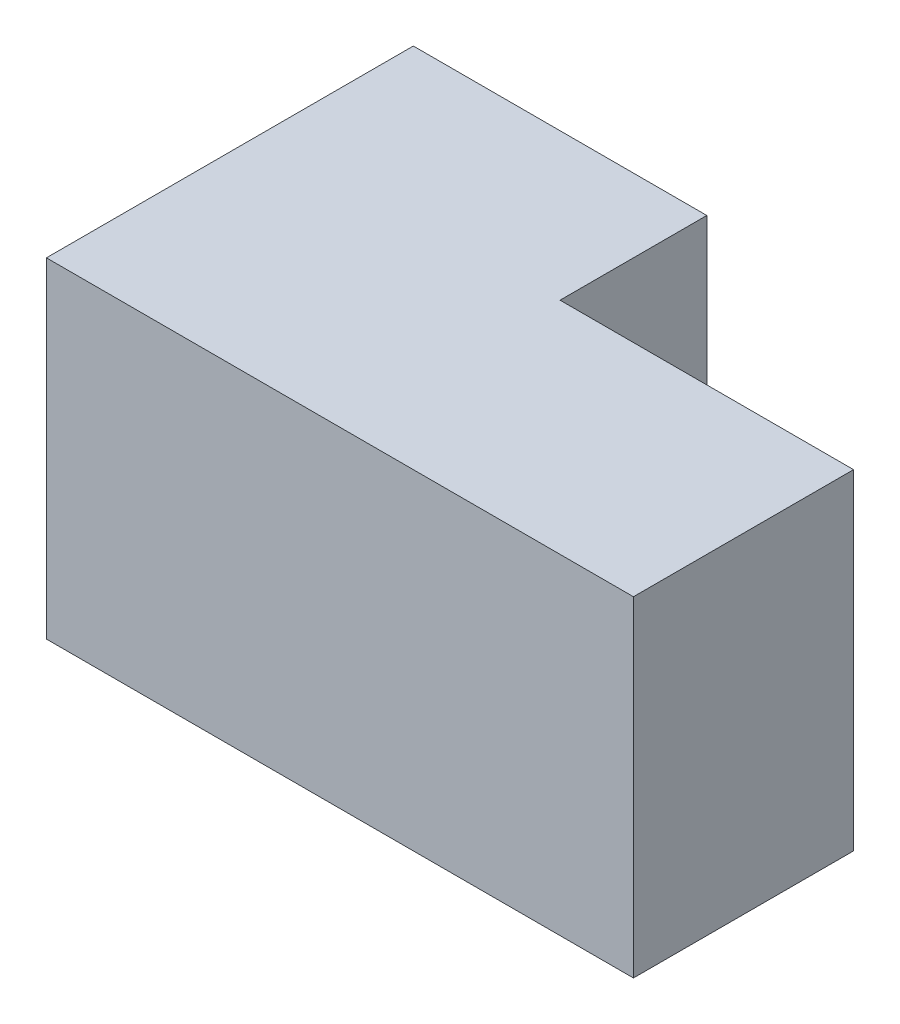
ISO-10303-21;
HEADER;
FILE_DESCRIPTION(('STEP AP214'),'2;1');
FILE_NAME('part.step','',(''),(''),'','','');
FILE_SCHEMA(('AUTOMOTIVE_DESIGN { 1 0 10303 214 1 1 1 1 }'));
ENDSEC;
DATA;
#1=APPLICATION_CONTEXT('core data for automotive mechanical design processes');
#2=APPLICATION_PROTOCOL_DEFINITION('international standard','automotive_design',2000,#1);
#3=PRODUCT_CONTEXT('',#1,'mechanical');
#4=PRODUCT('Part','Part','',(#3));
#5=PRODUCT_RELATED_PRODUCT_CATEGORY('part','',(#4));
#6=PRODUCT_DEFINITION_FORMATION('','',#4);
#7=PRODUCT_DEFINITION_CONTEXT('part definition',#1,'design');
#8=PRODUCT_DEFINITION('design','',#6,#7);
#9=PRODUCT_DEFINITION_SHAPE('','',#8);
#10=(LENGTH_UNIT() NAMED_UNIT(*) SI_UNIT(.MILLI.,.METRE.));
#11=(NAMED_UNIT(*) PLANE_ANGLE_UNIT() SI_UNIT($,.RADIAN.));
#12=(NAMED_UNIT(*) SI_UNIT($,.STERADIAN.) SOLID_ANGLE_UNIT());
#13=UNCERTAINTY_MEASURE_WITH_UNIT(LENGTH_MEASURE(1.E-05),#10,'distance_accuracy_value','');
#14=(GEOMETRIC_REPRESENTATION_CONTEXT(3) GLOBAL_UNCERTAINTY_ASSIGNED_CONTEXT((#13)) GLOBAL_UNIT_ASSIGNED_CONTEXT((#10,
#11,#12)) REPRESENTATION_CONTEXT('',''));
#15=CARTESIAN_POINT('',(0.,0.,0.));
#16=DIRECTION('',(0.,0.,1.));
#17=DIRECTION('',(1.,0.,0.));
#18=AXIS2_PLACEMENT_3D('',#15,#16,#17);
#19=CARTESIAN_POINT('',(25.4,28.575,-31.75));
#20=DIRECTION('',(0.,0.,1.));
#21=DIRECTION('',(1.,0.,0.));
#22=AXIS2_PLACEMENT_3D('',#19,#20,#21);
#23=PLANE('',#22);
#24=DIRECTION('',(-1.,0.,0.));
#25=VECTOR('',#24,1.);
#26=CARTESIAN_POINT('',(25.4,0.,-31.75));
#27=LINE('',#26,#25);
#28=CARTESIAN_POINT('',(25.4,0.,-31.75));
#29=VERTEX_POINT('',#28);
#30=CARTESIAN_POINT('',(0.,0.,-31.75));
#31=VERTEX_POINT('',#30);
#32=EDGE_CURVE('E132',#29,#31,#27,.T.);
#33=ORIENTED_EDGE('',*,*,#32,.T.);
#34=DIRECTION('',(0.,-1.,0.));
#35=VECTOR('',#34,1.);
#36=CARTESIAN_POINT('',(0.,28.575,-31.75));
#37=LINE('',#36,#35);
#38=CARTESIAN_POINT('',(0.,28.575,-31.75));
#39=VERTEX_POINT('',#38);
#40=EDGE_CURVE('E11',#39,#31,#37,.T.);
#41=ORIENTED_EDGE('',*,*,#40,.F.);
#42=DIRECTION('',(-1.,0.,0.));
#43=VECTOR('',#42,1.);
#44=CARTESIAN_POINT('',(25.4,28.575,-31.75));
#45=LINE('',#44,#43);
#46=CARTESIAN_POINT('',(25.4,28.575,-31.75));
#47=VERTEX_POINT('',#46);
#48=EDGE_CURVE('E148',#47,#39,#45,.T.);
#49=ORIENTED_EDGE('',*,*,#48,.F.);
#50=DIRECTION('',(0.,-1.,0.));
#51=VECTOR('',#50,1.);
#52=CARTESIAN_POINT('',(25.4,28.575,-31.75));
#53=LINE('',#52,#51);
#54=EDGE_CURVE('E128',#47,#29,#53,.T.);
#55=ORIENTED_EDGE('',*,*,#54,.T.);
#56=EDGE_LOOP('',(#33,#41,#49,#55));
#57=FACE_BOUND('',#56,.T.);
#58=ADVANCED_FACE('F42',(#57),#23,.F.);
#59=CARTESIAN_POINT('',(0.,28.575,-31.75));
#60=DIRECTION('',(1.,0.,0.));
#61=DIRECTION('',(0.,0.,-1.));
#62=AXIS2_PLACEMENT_3D('',#59,#60,#61);
#63=PLANE('',#62);
#64=DIRECTION('',(0.,0.,1.));
#65=VECTOR('',#64,1.);
#66=CARTESIAN_POINT('',(0.,0.,-31.75));
#67=LINE('',#66,#65);
#68=CARTESIAN_POINT('',(0.,0.,0.));
#69=VERTEX_POINT('',#68);
#70=EDGE_CURVE('E136',#31,#69,#67,.T.);
#71=ORIENTED_EDGE('',*,*,#70,.T.);
#72=DIRECTION('',(0.,-1.,0.));
#73=VECTOR('',#72,1.);
#74=CARTESIAN_POINT('',(0.,28.575,0.));
#75=LINE('',#74,#73);
#76=CARTESIAN_POINT('',(0.,28.575,0.));
#77=VERTEX_POINT('',#76);
#78=EDGE_CURVE('E51',#77,#69,#75,.T.);
#79=ORIENTED_EDGE('',*,*,#78,.F.);
#80=DIRECTION('',(0.,0.,1.));
#81=VECTOR('',#80,1.);
#82=CARTESIAN_POINT('',(0.,28.575,-31.75));
#83=LINE('',#82,#81);
#84=EDGE_CURVE('E96',#39,#77,#83,.T.);
#85=ORIENTED_EDGE('',*,*,#84,.F.);
#86=ORIENTED_EDGE('',*,*,#40,.T.);
#87=EDGE_LOOP('',(#71,#79,#85,#86));
#88=FACE_BOUND('',#87,.T.);
#89=ADVANCED_FACE('F177',(#88),#63,.F.);
#90=CARTESIAN_POINT('',(0.,28.575,0.));
#91=DIRECTION('',(0.,0.,-1.));
#92=DIRECTION('',(-1.,0.,0.));
#93=AXIS2_PLACEMENT_3D('',#90,#91,#92);
#94=PLANE('',#93);
#95=DIRECTION('',(1.,0.,0.));
#96=VECTOR('',#95,1.);
#97=CARTESIAN_POINT('',(0.,0.,0.));
#98=LINE('',#97,#96);
#99=CARTESIAN_POINT('',(50.8,0.,0.));
#100=VERTEX_POINT('',#99);
#101=EDGE_CURVE('E139',#69,#100,#98,.T.);
#102=ORIENTED_EDGE('',*,*,#101,.T.);
#103=DIRECTION('',(0.,-1.,0.));
#104=VECTOR('',#103,1.);
#105=CARTESIAN_POINT('',(50.8,28.575,0.));
#106=LINE('',#105,#104);
#107=CARTESIAN_POINT('',(50.8,28.575,0.));
#108=VERTEX_POINT('',#107);
#109=EDGE_CURVE('E120',#108,#100,#106,.T.);
#110=ORIENTED_EDGE('',*,*,#109,.F.);
#111=DIRECTION('',(1.,0.,0.));
#112=VECTOR('',#111,1.);
#113=CARTESIAN_POINT('',(0.,28.575,0.));
#114=LINE('',#113,#112);
#115=EDGE_CURVE('E109',#77,#108,#114,.T.);
#116=ORIENTED_EDGE('',*,*,#115,.F.);
#117=ORIENTED_EDGE('',*,*,#78,.T.);
#118=EDGE_LOOP('',(#102,#110,#116,#117));
#119=FACE_BOUND('',#118,.T.);
#120=ADVANCED_FACE('F159',(#119),#94,.F.);
#121=CARTESIAN_POINT('',(50.8,28.575,0.));
#122=DIRECTION('',(-1.,0.,0.));
#123=DIRECTION('',(0.,0.,1.));
#124=AXIS2_PLACEMENT_3D('',#121,#122,#123);
#125=PLANE('',#124);
#126=DIRECTION('',(0.,0.,-1.));
#127=VECTOR('',#126,1.);
#128=CARTESIAN_POINT('',(50.8,0.,0.));
#129=LINE('',#128,#127);
#130=CARTESIAN_POINT('',(50.8,0.,-19.05));
#131=VERTEX_POINT('',#130);
#132=EDGE_CURVE('E118',#100,#131,#129,.T.);
#133=ORIENTED_EDGE('',*,*,#132,.T.);
#134=DIRECTION('',(0.,-1.,0.));
#135=VECTOR('',#134,1.);
#136=CARTESIAN_POINT('',(50.8,28.575,-19.05));
#137=LINE('',#136,#135);
#138=CARTESIAN_POINT('',(50.8,28.575,-19.05));
#139=VERTEX_POINT('',#138);
#140=EDGE_CURVE('E115',#139,#131,#137,.T.);
#141=ORIENTED_EDGE('',*,*,#140,.F.);
#142=DIRECTION('',(0.,0.,-1.));
#143=VECTOR('',#142,1.);
#144=CARTESIAN_POINT('',(50.8,28.575,0.));
#145=LINE('',#144,#143);
#146=EDGE_CURVE('E103',#108,#139,#145,.T.);
#147=ORIENTED_EDGE('',*,*,#146,.F.);
#148=ORIENTED_EDGE('',*,*,#109,.T.);
#149=EDGE_LOOP('',(#133,#141,#147,#148));
#150=FACE_BOUND('',#149,.T.);
#151=ADVANCED_FACE('F116',(#150),#125,.F.);
#152=CARTESIAN_POINT('',(50.8,28.575,-19.05));
#153=DIRECTION('',(0.,0.,1.));
#154=DIRECTION('',(1.,0.,0.));
#155=AXIS2_PLACEMENT_3D('',#152,#153,#154);
#156=PLANE('',#155);
#157=DIRECTION('',(-1.,0.,0.));
#158=VECTOR('',#157,1.);
#159=CARTESIAN_POINT('',(50.8,0.,-19.05));
#160=LINE('',#159,#158);
#161=CARTESIAN_POINT('',(25.4,0.,-19.05));
#162=VERTEX_POINT('',#161);
#163=EDGE_CURVE('E82',#131,#162,#160,.T.);
#164=ORIENTED_EDGE('',*,*,#163,.T.);
#165=DIRECTION('',(0.,-1.,0.));
#166=VECTOR('',#165,1.);
#167=CARTESIAN_POINT('',(25.4,28.575,-19.05));
#168=LINE('',#167,#166);
#169=CARTESIAN_POINT('',(25.4,28.575,-19.05));
#170=VERTEX_POINT('',#169);
#171=EDGE_CURVE('E121',#170,#162,#168,.T.);
#172=ORIENTED_EDGE('',*,*,#171,.F.);
#173=DIRECTION('',(-1.,0.,0.));
#174=VECTOR('',#173,1.);
#175=CARTESIAN_POINT('',(50.8,28.575,-19.05));
#176=LINE('',#175,#174);
#177=EDGE_CURVE('E107',#139,#170,#176,.T.);
#178=ORIENTED_EDGE('',*,*,#177,.F.);
#179=ORIENTED_EDGE('',*,*,#140,.T.);
#180=EDGE_LOOP('',(#164,#172,#178,#179));
#181=FACE_BOUND('',#180,.T.);
#182=ADVANCED_FACE('F123',(#181),#156,.F.);
#183=CARTESIAN_POINT('',(25.4,28.575,-19.05));
#184=DIRECTION('',(-1.,0.,0.));
#185=DIRECTION('',(0.,0.,1.));
#186=AXIS2_PLACEMENT_3D('',#183,#184,#185);
#187=PLANE('',#186);
#188=DIRECTION('',(0.,0.,-1.));
#189=VECTOR('',#188,1.);
#190=CARTESIAN_POINT('',(25.4,0.,-19.05));
#191=LINE('',#190,#189);
#192=EDGE_CURVE('E88',#162,#29,#191,.T.);
#193=ORIENTED_EDGE('',*,*,#192,.T.);
#194=ORIENTED_EDGE('',*,*,#54,.F.);
#195=DIRECTION('',(0.,0.,-1.));
#196=VECTOR('',#195,1.);
#197=CARTESIAN_POINT('',(25.4,28.575,-19.05));
#198=LINE('',#197,#196);
#199=EDGE_CURVE('E59',#170,#47,#198,.T.);
#200=ORIENTED_EDGE('',*,*,#199,.F.);
#201=ORIENTED_EDGE('',*,*,#171,.T.);
#202=EDGE_LOOP('',(#193,#194,#200,#201));
#203=FACE_BOUND('',#202,.T.);
#204=ADVANCED_FACE('F166',(#203),#187,.F.);
#205=CARTESIAN_POINT('',(0.,28.575,0.));
#206=DIRECTION('',(0.,1.,0.));
#207=DIRECTION('',(0.,0.,1.));
#208=AXIS2_PLACEMENT_3D('',#205,#206,#207);
#209=PLANE('',#208);
#210=ORIENTED_EDGE('',*,*,#48,.T.);
#211=ORIENTED_EDGE('',*,*,#84,.T.);
#212=ORIENTED_EDGE('',*,*,#115,.T.);
#213=ORIENTED_EDGE('',*,*,#146,.T.);
#214=ORIENTED_EDGE('',*,*,#177,.T.);
#215=ORIENTED_EDGE('',*,*,#199,.T.);
#216=EDGE_LOOP('',(#210,#211,#212,#213,#214,#215));
#217=FACE_BOUND('',#216,.T.);
#218=ADVANCED_FACE('F105',(#217),#209,.T.);
#219=CARTESIAN_POINT('',(0.,0.,0.));
#220=DIRECTION('',(0.,1.,0.));
#221=DIRECTION('',(0.,0.,1.));
#222=AXIS2_PLACEMENT_3D('',#219,#220,#221);
#223=PLANE('',#222);
#224=ORIENTED_EDGE('',*,*,#32,.F.);
#225=ORIENTED_EDGE('',*,*,#192,.F.);
#226=ORIENTED_EDGE('',*,*,#163,.F.);
#227=ORIENTED_EDGE('',*,*,#132,.F.);
#228=ORIENTED_EDGE('',*,*,#101,.F.);
#229=ORIENTED_EDGE('',*,*,#70,.F.);
#230=EDGE_LOOP('',(#224,#225,#226,#227,#228,#229));
#231=FACE_BOUND('',#230,.T.);
#232=ADVANCED_FACE('F162',(#231),#223,.F.);
#233=CLOSED_SHELL('',(#58,#89,#120,#151,#182,#204,#218,#232));
#234=MANIFOLD_SOLID_BREP('B2',#233);
#235=ADVANCED_BREP_SHAPE_REPRESENTATION('',(#18,#234),#14);
#236=SHAPE_DEFINITION_REPRESENTATION(#9,#235);
ENDSEC;
END-ISO-10303-21;
